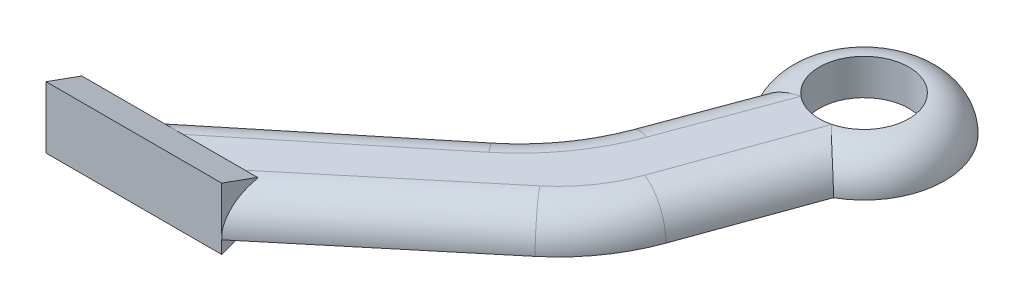
ISO-10303-21;
HEADER;
FILE_DESCRIPTION(('STEP AP214'),'2;1');
FILE_NAME('part.step','',(''),(''),'','','');
FILE_SCHEMA(('AUTOMOTIVE_DESIGN { 1 0 10303 214 1 1 1 1 }'));
ENDSEC;
DATA;
#1=APPLICATION_CONTEXT('core data for automotive mechanical design processes');
#2=APPLICATION_PROTOCOL_DEFINITION('international standard','automotive_design',2000,#1);
#3=PRODUCT_CONTEXT('',#1,'mechanical');
#4=PRODUCT('Part','Part','',(#3));
#5=PRODUCT_RELATED_PRODUCT_CATEGORY('part','',(#4));
#6=PRODUCT_DEFINITION_FORMATION('','',#4);
#7=PRODUCT_DEFINITION_CONTEXT('part definition',#1,'design');
#8=PRODUCT_DEFINITION('design','',#6,#7);
#9=PRODUCT_DEFINITION_SHAPE('','',#8);
#10=(LENGTH_UNIT() NAMED_UNIT(*) SI_UNIT(.MILLI.,.METRE.));
#11=(NAMED_UNIT(*) PLANE_ANGLE_UNIT() SI_UNIT($,.RADIAN.));
#12=(NAMED_UNIT(*) SI_UNIT($,.STERADIAN.) SOLID_ANGLE_UNIT());
#13=UNCERTAINTY_MEASURE_WITH_UNIT(LENGTH_MEASURE(1.E-05),#10,'distance_accuracy_value','');
#14=(GEOMETRIC_REPRESENTATION_CONTEXT(3) GLOBAL_UNCERTAINTY_ASSIGNED_CONTEXT((#13)) GLOBAL_UNIT_ASSIGNED_CONTEXT((#10,
#11,#12)) REPRESENTATION_CONTEXT('',''));
#15=CARTESIAN_POINT('',(0.,0.,0.));
#16=DIRECTION('',(0.,0.,1.));
#17=DIRECTION('',(1.,0.,0.));
#18=AXIS2_PLACEMENT_3D('',#15,#16,#17);
#19=CARTESIAN_POINT('',(11.4826257965562,2.,-14.3996307201945));
#20=DIRECTION('',(0.,1.,0.));
#21=DIRECTION('',(0.,0.,1.));
#22=AXIS2_PLACEMENT_3D('',#19,#20,#21);
#23=PLANE('',#22);
#24=DIRECTION('',(1.,0.,0.));
#25=VECTOR('',#24,1.);
#26=CARTESIAN_POINT('',(-11.15,2.,6.60036927980545));
#27=LINE('',#26,#25);
#28=CARTESIAN_POINT('',(-5.50829123776774,2.,6.60036927980545));
#29=VERTEX_POINT('',#28);
#30=CARTESIAN_POINT('',(-2.04227215778598,2.,6.60036927980545));
#31=VERTEX_POINT('',#30);
#32=EDGE_CURVE('E179',#29,#31,#27,.T.);
#33=ORIENTED_EDGE('',*,*,#32,.T.);
#34=DIRECTION('',(0.768811989561023,0.,-0.639474881998676));
#35=VECTOR('',#34,1.);
#36=CARTESIAN_POINT('',(6.92807142678192,2.,-0.860894960499203));
#37=LINE('',#36,#35);
#38=CARTESIAN_POINT('',(6.92807142678192,2.,-0.860894960499203));
#39=VERTEX_POINT('',#38);
#40=EDGE_CURVE('E216',#31,#39,#37,.T.);
#41=ORIENTED_EDGE('',*,*,#40,.T.);
#42=CARTESIAN_POINT('',(1.8122723707925,2.,-7.01139087698739));
#43=DIRECTION('',(0.,1.,0.));
#44=DIRECTION('',(0.,0.,1.));
#45=AXIS2_PLACEMENT_3D('',#42,#43,#44);
#46=CIRCLE('',#45,8.);
#47=CARTESIAN_POINT('',(9.3378989984167,2.,-4.29754787091764));
#48=VERTEX_POINT('',#47);
#49=EDGE_CURVE('E218',#39,#48,#46,.T.);
#50=ORIENTED_EDGE('',*,*,#49,.T.);
#51=DIRECTION('',(0.339230375758719,0.,-0.940703328453024));
#52=VECTOR('',#51,1.);
#53=CARTESIAN_POINT('',(11.812107756407,2.,-11.1586563690097));
#54=LINE('',#53,#52);
#55=CARTESIAN_POINT('',(12.1079729417804,2.,-11.9791057878793));
#56=VERTEX_POINT('',#55);
#57=EDGE_CURVE('E220',#48,#56,#54,.T.);
#58=ORIENTED_EDGE('',*,*,#57,.T.);
#59=CARTESIAN_POINT('',(11.4826257965562,2.,-14.3996307201945));
#60=DIRECTION('',(0.,1.,0.));
#61=DIRECTION('',(0.,0.,1.));
#62=AXIS2_PLACEMENT_3D('',#59,#60,#61);
#63=CIRCLE('',#62,2.5);
#64=CARTESIAN_POINT('',(9.88318716538032,2.,-12.4782260087654));
#65=VERTEX_POINT('',#64);
#66=EDGE_CURVE('E191',#65,#56,#63,.T.);
#67=ORIENTED_EDGE('',*,*,#66,.F.);
#68=DIRECTION('',(-0.347398248181745,0.,0.937717685212482));
#69=VECTOR('',#68,1.);
#70=CARTESIAN_POINT('',(7.5557513281761,2.,-6.19587496880874));
#71=LINE('',#70,#69);
#72=CARTESIAN_POINT('',(7.5557513281761,2.,-6.19587496880874));
#73=VERTEX_POINT('',#72);
#74=EDGE_CURVE('E60',#65,#73,#71,.T.);
#75=ORIENTED_EDGE('',*,*,#74,.T.);
#76=CARTESIAN_POINT('',(-3.69686089437368,2.,-10.3646539469897));
#77=DIRECTION('',(0.,1.,0.));
#78=DIRECTION('',(0.,0.,1.));
#79=AXIS2_PLACEMENT_3D('',#76,#77,#78);
#80=CIRCLE('',#79,12.);
#81=CARTESIAN_POINT('',(3.88908115511307,2.,-1.06661742190392));
#82=VERTEX_POINT('',#81);
#83=EDGE_CURVE('E225',#73,#82,#80,.F.);
#84=ORIENTED_EDGE('',*,*,#83,.T.);
#85=DIRECTION('',(-0.77483637709048,0.,0.632161837457229));
#86=VECTOR('',#85,1.);
#87=CARTESIAN_POINT('',(-9.85910049852519,2.,10.1500420339864));
#88=LINE('',#87,#86);
#89=EDGE_CURVE('E222',#82,#29,#88,.T.);
#90=ORIENTED_EDGE('',*,*,#89,.T.);
#91=EDGE_LOOP('',(#33,#41,#50,#58,#67,#75,#84,#90));
#92=FACE_BOUND('',#91,.T.);
#93=ADVANCED_FACE('F36',(#92),#23,.T.);
#94=CARTESIAN_POINT('',(11.4826257965562,0.,-14.3996307201945));
#95=DIRECTION('',(0.,1.,0.));
#96=DIRECTION('',(0.,0.,1.));
#97=AXIS2_PLACEMENT_3D('',#94,#95,#96);
#98=PLANE('',#97);
#99=DIRECTION('',(0.,0.,1.));
#100=VECTOR('',#99,1.);
#101=CARTESIAN_POINT('',(-1.35,0.,-14.3996307201945));
#102=LINE('',#101,#100);
#103=CARTESIAN_POINT('',(-1.35,0.,6.60036927980545));
#104=VERTEX_POINT('',#103);
#105=CARTESIAN_POINT('',(-1.35,0.,8.60036927980545));
#106=VERTEX_POINT('',#105);
#107=EDGE_CURVE('E141',#104,#106,#102,.T.);
#108=ORIENTED_EDGE('',*,*,#107,.F.);
#109=DIRECTION('',(1.,0.,0.));
#110=VECTOR('',#109,1.);
#111=CARTESIAN_POINT('',(-11.15,0.,6.60036927980545));
#112=LINE('',#111,#110);
#113=CARTESIAN_POINT('',(-8.67203805305271,0.,6.60036927980545));
#114=VERTEX_POINT('',#113);
#115=EDGE_CURVE('E153',#114,#104,#112,.T.);
#116=ORIENTED_EDGE('',*,*,#115,.F.);
#117=DIRECTION('',(-0.77483637709048,0.,0.632161837457229));
#118=VECTOR('',#117,1.);
#119=CARTESIAN_POINT('',(4.73443918794363,0.,-4.33750552457679));
#120=LINE('',#119,#118);
#121=CARTESIAN_POINT('',(2.62475748019861,0.,-2.61629017608488));
#122=VERTEX_POINT('',#121);
#123=EDGE_CURVE('E198',#122,#114,#120,.T.);
#124=ORIENTED_EDGE('',*,*,#123,.F.);
#125=CARTESIAN_POINT('',(-3.69686089437368,0.,-10.3646539469897));
#126=DIRECTION('',(0.,1.,0.));
#127=DIRECTION('',(0.,0.,1.));
#128=AXIS2_PLACEMENT_3D('',#125,#126,#127);
#129=CIRCLE('',#128,10.);
#130=CARTESIAN_POINT('',(5.68031595775114,0.,-6.89067146517223));
#131=VERTEX_POINT('',#130);
#132=EDGE_CURVE('E214',#122,#131,#129,.T.);
#133=ORIENTED_EDGE('',*,*,#132,.T.);
#134=DIRECTION('',(-0.347398248181745,0.,0.937717685212482));
#135=VECTOR('',#134,1.);
#136=CARTESIAN_POINT('',(7.61190342688268,0.,-12.1045254204515));
#137=LINE('',#136,#135);
#138=CARTESIAN_POINT('',(7.61190342688268,0.,-12.1045254204515));
#139=VERTEX_POINT('',#138);
#140=EDGE_CURVE('E190',#139,#131,#137,.T.);
#141=ORIENTED_EDGE('',*,*,#140,.F.);
#142=CARTESIAN_POINT('',(11.4826257965562,0.,-14.3996307201945));
#143=DIRECTION('',(0.,1.,0.));
#144=DIRECTION('',(0.,0.,1.));
#145=AXIS2_PLACEMENT_3D('',#142,#143,#144);
#146=CIRCLE('',#145,4.5);
#147=CARTESIAN_POINT('',(13.693514413313,0.,-10.4801956174922));
#148=VERTEX_POINT('',#147);
#149=EDGE_CURVE('E209',#148,#139,#146,.T.);
#150=ORIENTED_EDGE('',*,*,#149,.F.);
#151=DIRECTION('',(0.339230375758719,0.,-0.940703328453024));
#152=VECTOR('',#151,1.);
#153=CARTESIAN_POINT('',(10.2970860518292,0.,-1.06172459362196));
#154=LINE('',#153,#152);
#155=CARTESIAN_POINT('',(11.2193056553227,0.,-3.6190871194002));
#156=VERTEX_POINT('',#155);
#157=EDGE_CURVE('E206',#156,#148,#154,.T.);
#158=ORIENTED_EDGE('',*,*,#157,.F.);
#159=CARTESIAN_POINT('',(1.8122723707925,0.,-7.01139087698739));
#160=DIRECTION('',(0.,1.,0.));
#161=DIRECTION('',(0.,0.,1.));
#162=AXIS2_PLACEMENT_3D('',#159,#160,#161);
#163=CIRCLE('',#162,10.);
#164=CARTESIAN_POINT('',(8.20702119077927,0.,0.676729018622842));
#165=VERTEX_POINT('',#164);
#166=EDGE_CURVE('E212',#156,#165,#163,.F.);
#167=ORIENTED_EDGE('',*,*,#166,.T.);
#168=DIRECTION('',(0.768811989561023,0.,-0.639474881998676));
#169=VECTOR('',#168,1.);
#170=CARTESIAN_POINT('',(-1.31921636014026,0.,8.60036927980545));
#171=LINE('',#170,#169);
#172=CARTESIAN_POINT('',(-1.31921636014026,0.,8.60036927980545));
#173=VERTEX_POINT('',#172);
#174=EDGE_CURVE('E203',#173,#165,#171,.T.);
#175=ORIENTED_EDGE('',*,*,#174,.F.);
#176=DIRECTION('',(1.,0.,0.));
#177=VECTOR('',#176,1.);
#178=CARTESIAN_POINT('',(-11.1234241734397,0.,8.60036927980545));
#179=LINE('',#178,#177);
#180=EDGE_CURVE('E201',#106,#173,#179,.T.);
#181=ORIENTED_EDGE('',*,*,#180,.F.);
#182=EDGE_LOOP('',(#108,#116,#124,#133,#141,#150,#158,#167,#175,#181));
#183=FACE_BOUND('',#182,.T.);
#184=CARTESIAN_POINT('',(11.4826257965562,0.,-14.3996307201945));
#185=DIRECTION('',(0.,1.,0.));
#186=DIRECTION('',(0.,0.,1.));
#187=AXIS2_PLACEMENT_3D('',#184,#185,#186);
#188=CIRCLE('',#187,2.5);
#189=CARTESIAN_POINT('',(11.4826257965562,0.,-11.8996307201945));
#190=VERTEX_POINT('',#189);
#191=EDGE_CURVE('E192',#190,#190,#188,.T.);
#192=ORIENTED_EDGE('',*,*,#191,.T.);
#193=EDGE_LOOP('',(#192));
#194=FACE_BOUND('',#193,.T.);
#195=ADVANCED_FACE('F282',(#183,#194),#98,.F.);
#196=CARTESIAN_POINT('',(-11.1234241734397,2.,8.60036927980545));
#197=DIRECTION('',(0.,0.,-1.));
#198=DIRECTION('',(-1.,0.,0.));
#199=AXIS2_PLACEMENT_3D('',#196,#197,#198);
#200=PLANE('',#199);
#201=DIRECTION('',(0.,-1.,0.));
#202=VECTOR('',#201,1.);
#203=CARTESIAN_POINT('',(-1.35,-0.725,8.60036927980545));
#204=LINE('',#203,#202);
#205=CARTESIAN_POINT('',(-1.35,-0.725,8.60036927980545));
#206=VERTEX_POINT('',#205);
#207=EDGE_CURVE('E135',#106,#206,#204,.T.);
#208=ORIENTED_EDGE('',*,*,#207,.F.);
#209=ORIENTED_EDGE('',*,*,#180,.T.);
#210=CARTESIAN_POINT('',(-4.44678251840594,0.,8.60036927980545));
#211=DIRECTION('',(0.,0.,-1.));
#212=DIRECTION('',(-1.,0.,0.));
#213=AXIS2_PLACEMENT_3D('',#210,#211,#212);
#214=ELLIPSE('',#213,3.12756615826568,2.);
#215=CARTESIAN_POINT('',(-1.35,0.279917745584298,8.60036927980545));
#216=VERTEX_POINT('',#215);
#217=EDGE_CURVE('E228',#173,#216,#214,.F.);
#218=ORIENTED_EDGE('',*,*,#217,.T.);
#219=CARTESIAN_POINT('',(-1.35,2.725,8.60036927980545));
#220=VERTEX_POINT('',#219);
#221=EDGE_CURVE('E52',#220,#216,#204,.T.);
#222=ORIENTED_EDGE('',*,*,#221,.F.);
#223=DIRECTION('',(1.,0.,0.));
#224=VECTOR('',#223,1.);
#225=CARTESIAN_POINT('',(-11.15,2.725,8.60036927980545));
#226=LINE('',#225,#224);
#227=CARTESIAN_POINT('',(-11.15,2.725,8.60036927980545));
#228=VERTEX_POINT('',#227);
#229=EDGE_CURVE('E174',#228,#220,#226,.T.);
#230=ORIENTED_EDGE('',*,*,#229,.F.);
#231=DIRECTION('',(0.,-1.,0.));
#232=VECTOR('',#231,1.);
#233=CARTESIAN_POINT('',(-11.15,-0.725,8.60036927980545));
#234=LINE('',#233,#232);
#235=CARTESIAN_POINT('',(-11.15,-0.725,8.60036927980545));
#236=VERTEX_POINT('',#235);
#237=EDGE_CURVE('E149',#228,#236,#234,.T.);
#238=ORIENTED_EDGE('',*,*,#237,.T.);
#239=DIRECTION('',(1.,0.,0.));
#240=VECTOR('',#239,1.);
#241=CARTESIAN_POINT('',(-11.15,-0.725,8.60036927980545));
#242=LINE('',#241,#240);
#243=EDGE_CURVE('E146',#236,#206,#242,.T.);
#244=ORIENTED_EDGE('',*,*,#243,.T.);
#245=EDGE_LOOP('',(#208,#209,#218,#222,#230,#238,#244));
#246=FACE_BOUND('',#245,.T.);
#247=ADVANCED_FACE('F147',(#246),#200,.F.);
#248=CARTESIAN_POINT('',(11.4826257965562,2.,-14.3996307201945));
#249=DIRECTION('',(0.,-1.,0.));
#250=DIRECTION('',(0.,0.,-1.));
#251=AXIS2_PLACEMENT_3D('',#248,#249,#250);
#252=CYLINDRICAL_SURFACE('',#251,2.5);
#253=EDGE_CURVE('E187',#56,#65,#63,.T.);
#254=ORIENTED_EDGE('',*,*,#253,.T.);
#255=ORIENTED_EDGE('',*,*,#66,.T.);
#256=EDGE_LOOP('',(#254,#255));
#257=FACE_BOUND('',#256,.T.);
#258=ORIENTED_EDGE('',*,*,#191,.F.);
#259=EDGE_LOOP('',(#258));
#260=FACE_BOUND('',#259,.T.);
#261=ADVANCED_FACE('F266',(#257,#260),#252,.F.);
#262=CARTESIAN_POINT('',(14.9788313460514,0.,-10.1143558411684));
#263=DIRECTION('',(0.77483637709048,0.,-0.632161837457229));
#264=DIRECTION('',(-0.632161837457229,0.,-0.77483637709048));
#265=AXIS2_PLACEMENT_3D('',#262,#263,#264);
#266=CYLINDRICAL_SURFACE('',#265,2.);
#267=CARTESIAN_POINT('',(-5.50829123776774,0.,6.60036927980545));
#268=DIRECTION('',(0.,0.,-1.));
#269=DIRECTION('',(1.,0.,0.));
#270=AXIS2_PLACEMENT_3D('',#267,#268,#269);
#271=ELLIPSE('',#270,3.16374681528496,2.);
#272=EDGE_CURVE('E184',#29,#114,#271,.F.);
#273=ORIENTED_EDGE('',*,*,#272,.F.);
#274=ORIENTED_EDGE('',*,*,#89,.F.);
#275=CARTESIAN_POINT('',(3.88908115511307,0.,-1.06661742190392));
#276=DIRECTION('',(0.77483637709048,0.,-0.632161837457229));
#277=DIRECTION('',(-0.632161837457229,0.,-0.77483637709048));
#278=AXIS2_PLACEMENT_3D('',#275,#276,#277);
#279=CIRCLE('',#278,2.);
#280=EDGE_CURVE('E195',#122,#82,#279,.T.);
#281=ORIENTED_EDGE('',*,*,#280,.F.);
#282=ORIENTED_EDGE('',*,*,#123,.T.);
#283=EDGE_LOOP('',(#273,#274,#281,#282));
#284=FACE_BOUND('',#283,.T.);
#285=ADVANCED_FACE('F263',(#284),#266,.T.);
#286=CARTESIAN_POINT('',(-3.69686089437368,0.,-10.3646539469897));
#287=DIRECTION('',(0.,1.,0.));
#288=DIRECTION('',(0.,0.,1.));
#289=AXIS2_PLACEMENT_3D('',#286,#287,#288);
#290=TOROIDAL_SURFACE('',#289,12.,2.);
#291=ORIENTED_EDGE('',*,*,#280,.T.);
#292=ORIENTED_EDGE('',*,*,#83,.F.);
#293=CARTESIAN_POINT('',(7.5557513281761,0.,-6.19587496880874));
#294=DIRECTION('',(0.347398248181745,0.,-0.937717685212482));
#295=DIRECTION('',(-0.937717685212482,0.,-0.347398248181745));
#296=AXIS2_PLACEMENT_3D('',#293,#294,#295);
#297=CIRCLE('',#296,2.);
#298=EDGE_CURVE('E232',#131,#73,#297,.T.);
#299=ORIENTED_EDGE('',*,*,#298,.F.);
#300=ORIENTED_EDGE('',*,*,#132,.F.);
#301=EDGE_LOOP('',(#291,#292,#299,#300));
#302=FACE_BOUND('',#301,.T.);
#303=ADVANCED_FACE('F259',(#302),#290,.T.);
#304=CARTESIAN_POINT('',(10.7021359294715,0.,-14.6887804470523));
#305=DIRECTION('',(0.347398248181745,0.,-0.937717685212482));
#306=DIRECTION('',(-0.937717685212482,0.,-0.347398248181745));
#307=AXIS2_PLACEMENT_3D('',#304,#305,#306);
#308=CYLINDRICAL_SURFACE('',#307,2.);
#309=ORIENTED_EDGE('',*,*,#74,.F.);
#310=CARTESIAN_POINT('',(7.61190342688268,0.,-12.1045254204515));
#311=CARTESIAN_POINT('',(7.61189543352078,0.0520283875366276,-12.1045262232534));
#312=CARTESIAN_POINT('',(7.61414339430645,0.104052964419755,-12.1047280739774));
#313=CARTESIAN_POINT('',(7.62308994926808,0.207704438460941,-12.105539429095));
#314=CARTESIAN_POINT('',(7.62978763009234,0.259331415031186,-12.1061488498307));
#315=CARTESIAN_POINT('',(7.6475467799877,0.361671672877254,-12.1077785477575));
#316=CARTESIAN_POINT('',(7.65859562252087,0.412387157839133,-12.1087976363189));
#317=CARTESIAN_POINT('',(7.68492912514579,0.512681922597367,-12.1112567415172));
#318=CARTESIAN_POINT('',(7.70021385815536,0.56226118281852,-12.1126967654001));
#319=CARTESIAN_POINT('',(7.75219834246821,0.708747710079285,-12.1176685979388));
#320=CARTESIAN_POINT('',(7.79504999413708,0.803526311350247,-12.1218540280005));
#321=CARTESIAN_POINT('',(7.89544489323164,0.984780760737217,-12.1321135387336));
#322=CARTESIAN_POINT('',(7.95299390003438,1.07125333569153,-12.1381883599949));
#323=CARTESIAN_POINT('',(8.08277301030972,1.23668369975567,-12.1526471361493));
#324=CARTESIAN_POINT('',(8.15541305794058,1.31531355918635,-12.1610986019576));
#325=CARTESIAN_POINT('',(8.31166308370237,1.46038071036489,-12.1804522363457));
#326=CARTESIAN_POINT('',(8.39527542737518,1.52681536549118,-12.1913549337545));
#327=CARTESIAN_POINT('',(8.57861945643107,1.65190834001899,-12.2169281844484));
#328=CARTESIAN_POINT('',(8.67912074017512,1.70938631810406,-12.23184411115));
#329=CARTESIAN_POINT('',(8.88709032135319,1.80864778032583,-12.2651943235526));
#330=CARTESIAN_POINT('',(8.99456485297788,1.85041698742653,-12.2836317869956));
#331=CARTESIAN_POINT('',(9.22965456264571,1.9234054525493,-12.327317552917));
#332=CARTESIAN_POINT('',(9.35791266490508,1.95218060470861,-12.3531680620895));
#333=CARTESIAN_POINT('',(9.61586564248934,1.99024937910358,-12.4103304088893));
#334=CARTESIAN_POINT('',(9.74555771894426,1.99957588859287,-12.4416329299716));
#335=CARTESIAN_POINT('',(9.87725407027953,1.99999530365834,-12.4766436593888));
#336=CARTESIAN_POINT('',(9.88022088463565,2.00000001596779,-12.4774340574169));
#337=CARTESIAN_POINT('',(9.88318716538032,2.,-12.4782260087654));
#338=B_SPLINE_CURVE_WITH_KNOTS('',3,(#310,#311,#312,#313,#314,#315,#316,#317,#318,#319,#320,
#321,#322,#323,#324,#325,#326,#327,#328,#329,#330,#331,#332,#333,#334,#335,#336,#337),
.UNSPECIFIED.,.F.,.F.,(4,2,2,2,2,2,2,2,2,2,2,2,2,4),(0.,0.156029713161231,0.312027409478255,
0.467575716396317,0.62312670113319,0.933859930965681,1.24471511357013,1.5654916485293,
1.88633745438656,2.23511270915112,2.58420418928672,2.98446938566176,3.38405719116916,
3.39326806890228),.UNSPECIFIED.);
#339=EDGE_CURVE('E231',#65,#139,#338,.F.);
#340=ORIENTED_EDGE('',*,*,#339,.T.);
#341=ORIENTED_EDGE('',*,*,#140,.T.);
#342=ORIENTED_EDGE('',*,*,#298,.T.);
#343=EDGE_LOOP('',(#309,#340,#341,#342));
#344=FACE_BOUND('',#343,.T.);
#345=ADVANCED_FACE('F253',(#344),#308,.T.);
#346=CARTESIAN_POINT('',(16.2762697216083,0.,-8.63644747873922));
#347=DIRECTION('',(-0.768811989561023,0.,0.639474881998676));
#348=DIRECTION('',(0.639474881998676,0.,0.768811989561023));
#349=AXIS2_PLACEMENT_3D('',#346,#347,#348);
#350=CYLINDRICAL_SURFACE('',#349,2.);
#351=CARTESIAN_POINT('',(-2.04227215778598,0.,6.60036927980545));
#352=DIRECTION('',(0.,0.,-1.));
#353=DIRECTION('',(-1.,0.,0.));
#354=AXIS2_PLACEMENT_3D('',#351,#352,#353);
#355=ELLIPSE('',#354,3.12756615826568,2.);
#356=CARTESIAN_POINT('',(-1.35,1.95039098201521,6.60036927980545));
#357=VERTEX_POINT('',#356);
#358=EDGE_CURVE('E11',#357,#31,#355,.F.);
#359=ORIENTED_EDGE('',*,*,#358,.F.);
#360=CARTESIAN_POINT('',(-1.35,0.,6.02455794696721));
#361=DIRECTION('',(-1.,0.,0.));
#362=DIRECTION('',(0.,0.,1.));
#363=AXIS2_PLACEMENT_3D('',#360,#361,#362);
#364=ELLIPSE('',#363,2.60141624630745,2.);
#365=EDGE_CURVE('E45',#357,#216,#364,.F.);
#366=ORIENTED_EDGE('',*,*,#365,.T.);
#367=ORIENTED_EDGE('',*,*,#217,.F.);
#368=ORIENTED_EDGE('',*,*,#174,.T.);
#369=CARTESIAN_POINT('',(6.92807142678192,0.,-0.860894960499203));
#370=DIRECTION('',(0.768811989561023,0.,-0.639474881998676));
#371=DIRECTION('',(-0.639474881998676,0.,-0.768811989561023));
#372=AXIS2_PLACEMENT_3D('',#369,#370,#371);
#373=CIRCLE('',#372,2.);
#374=EDGE_CURVE('E234',#39,#165,#373,.T.);
#375=ORIENTED_EDGE('',*,*,#374,.F.);
#376=ORIENTED_EDGE('',*,*,#40,.F.);
#377=EDGE_LOOP('',(#359,#366,#367,#368,#375,#376));
#378=FACE_BOUND('',#377,.T.);
#379=ADVANCED_FACE('F258',(#378),#350,.T.);
#380=CARTESIAN_POINT('',(1.8122723707925,0.,-7.01139087698739));
#381=DIRECTION('',(0.,1.,0.));
#382=DIRECTION('',(0.,0.,1.));
#383=AXIS2_PLACEMENT_3D('',#380,#381,#382);
#384=TOROIDAL_SURFACE('',#383,8.,2.);
#385=ORIENTED_EDGE('',*,*,#374,.T.);
#386=ORIENTED_EDGE('',*,*,#166,.F.);
#387=CARTESIAN_POINT('',(9.3378989984167,0.,-4.29754787091764));
#388=DIRECTION('',(0.339230375758719,0.,-0.940703328453024));
#389=DIRECTION('',(-0.940703328453024,0.,-0.339230375758719));
#390=AXIS2_PLACEMENT_3D('',#387,#388,#389);
#391=CIRCLE('',#390,2.);
#392=EDGE_CURVE('E186',#48,#156,#391,.T.);
#393=ORIENTED_EDGE('',*,*,#392,.F.);
#394=ORIENTED_EDGE('',*,*,#49,.F.);
#395=EDGE_LOOP('',(#385,#386,#393,#394));
#396=FACE_BOUND('',#395,.T.);
#397=ADVANCED_FACE('F272',(#396),#384,.T.);
#398=CARTESIAN_POINT('',(12.8084358747006,0.,-13.921525628621));
#399=DIRECTION('',(-0.339230375758719,0.,0.940703328453024));
#400=DIRECTION('',(0.940703328453024,0.,0.339230375758719));
#401=AXIS2_PLACEMENT_3D('',#398,#399,#400);
#402=CYLINDRICAL_SURFACE('',#401,2.);
#403=ORIENTED_EDGE('',*,*,#392,.T.);
#404=ORIENTED_EDGE('',*,*,#157,.T.);
#405=CARTESIAN_POINT('',(13.693514413313,0.,-10.4801956174922));
#406=CARTESIAN_POINT('',(13.6935206015833,0.0535290515420343,-10.4801920632802));
#407=CARTESIAN_POINT('',(13.6917636364918,0.107054740295363,-10.4816752709105));
#408=CARTESIAN_POINT('',(13.6847706272418,0.213707040085185,-10.4875874777269));
#409=CARTESIAN_POINT('',(13.6795350977507,0.266833708982499,-10.4920160411361));
#410=CARTESIAN_POINT('',(13.6656469622341,0.372199391018941,-10.5037787069259));
#411=CARTESIAN_POINT('',(13.6570016554297,0.424440053275847,-10.5111066028867));
#412=CARTESIAN_POINT('',(13.6363943848645,0.527763440286034,-10.5286070655638));
#413=CARTESIAN_POINT('',(13.6244323997996,0.578846157599189,-10.5387796505525));
#414=CARTESIAN_POINT('',(13.5837393605981,0.72981961748166,-10.5734676457845));
#415=CARTESIAN_POINT('',(13.5501882878966,0.827532252330864,-10.6021641468197));
#416=CARTESIAN_POINT('',(13.4716192624409,1.01432148114702,-10.6698749951854));
#417=CARTESIAN_POINT('',(13.4265992827097,1.10339654469186,-10.7088911664272));
#418=CARTESIAN_POINT('',(13.3257203823923,1.27266520062614,-10.7971814060579));
#419=CARTESIAN_POINT('',(13.2696490582893,1.35262641398134,-10.8466581543752));
#420=CARTESIAN_POINT('',(13.1493973648619,1.49968892387532,-10.9541068178581));
#421=CARTESIAN_POINT('',(13.0852150322487,1.56678709695409,-11.0120807903417));
#422=CARTESIAN_POINT('',(12.9471257908999,1.69039080440248,-11.1387261646872));
#423=CARTESIAN_POINT('',(12.8728736116376,1.74607833520236,-11.2078181125366));
#424=CARTESIAN_POINT('',(12.7203459894761,1.84109280374306,-11.3525316463373));
#425=CARTESIAN_POINT('',(12.6420687196115,1.88041223712326,-11.4281562081838));
#426=CARTESIAN_POINT('',(12.4882816488727,1.94083975024881,-11.5802164512471));
#427=CARTESIAN_POINT('',(12.412847993636,1.96280998501108,-11.6563920333859));
#428=CARTESIAN_POINT('',(12.2627109958039,1.99215718070933,-11.811982496122));
#429=CARTESIAN_POINT('',(12.1880065576385,1.99956114975142,-11.891391102499));
#430=CARTESIAN_POINT('',(12.11239205861,1.9999937079616,-11.9742562173392));
#431=CARTESIAN_POINT('',(12.1101818959228,2.0000000195465,-11.9766805427118));
#432=CARTESIAN_POINT('',(12.1079729417804,2.,-11.9791057878793));
#433=B_SPLINE_CURVE_WITH_KNOTS('',3,(#405,#406,#407,#408,#409,#410,#411,#412,#413,#414,#415,
#416,#417,#418,#419,#420,#421,#422,#423,#424,#425,#426,#427,#428,#429,#430,#431,#432),
.UNSPECIFIED.,.F.,.F.,(4,2,2,2,2,2,2,2,2,2,2,2,2,4),(0.,0.16053195849016,0.321040170924062,
0.481206636430515,0.641374130760214,0.961418689782529,1.28151985172015,1.60850954501276,
1.93557853908486,2.28122266166902,2.62702507931526,2.95431744541945,3.28100238685324,
3.29084409847999),.UNSPECIFIED.);
#434=EDGE_CURVE('E247',#148,#56,#433,.T.);
#435=ORIENTED_EDGE('',*,*,#434,.T.);
#436=ORIENTED_EDGE('',*,*,#57,.F.);
#437=EDGE_LOOP('',(#403,#404,#435,#436));
#438=FACE_BOUND('',#437,.T.);
#439=ADVANCED_FACE('F268',(#438),#402,.T.);
#440=CARTESIAN_POINT('',(11.4826257965562,0.,-14.3996307201945));
#441=DIRECTION('',(0.,1.,0.));
#442=DIRECTION('',(0.,0.,1.));
#443=AXIS2_PLACEMENT_3D('',#440,#441,#442);
#444=TOROIDAL_SURFACE('',#443,2.5,2.);
#445=ORIENTED_EDGE('',*,*,#434,.F.);
#446=ORIENTED_EDGE('',*,*,#149,.T.);
#447=ORIENTED_EDGE('',*,*,#339,.F.);
#448=ORIENTED_EDGE('',*,*,#253,.F.);
#449=EDGE_LOOP('',(#445,#446,#447,#448));
#450=FACE_BOUND('',#449,.T.);
#451=ADVANCED_FACE('F38',(#450),#444,.T.);
#452=CARTESIAN_POINT('',(-11.15,2.,6.60036927980545));
#453=DIRECTION('',(0.,0.,-1.));
#454=DIRECTION('',(-1.,0.,0.));
#455=AXIS2_PLACEMENT_3D('',#452,#453,#454);
#456=PLANE('',#455);
#457=CARTESIAN_POINT('',(-11.15,2.,6.60036927980545));
#458=VERTEX_POINT('',#457);
#459=EDGE_CURVE('E176',#458,#29,#27,.T.);
#460=ORIENTED_EDGE('',*,*,#459,.T.);
#461=ORIENTED_EDGE('',*,*,#272,.T.);
#462=CARTESIAN_POINT('',(-11.15,0.,6.60036927980545));
#463=VERTEX_POINT('',#462);
#464=EDGE_CURVE('E181',#463,#114,#112,.T.);
#465=ORIENTED_EDGE('',*,*,#464,.F.);
#466=DIRECTION('',(0.,1.,0.));
#467=VECTOR('',#466,1.);
#468=CARTESIAN_POINT('',(-11.15,2.,6.60036927980545));
#469=LINE('',#468,#467);
#470=EDGE_CURVE('E169',#463,#458,#469,.T.);
#471=ORIENTED_EDGE('',*,*,#470,.T.);
#472=EDGE_LOOP('',(#460,#461,#465,#471));
#473=FACE_BOUND('',#472,.T.);
#474=ADVANCED_FACE('F302',(#473),#456,.T.);
#475=CARTESIAN_POINT('',(-1.35,0.,0.));
#476=DIRECTION('',(-1.,0.,0.));
#477=DIRECTION('',(0.,0.,1.));
#478=AXIS2_PLACEMENT_3D('',#475,#476,#477);
#479=PLANE('',#478);
#480=DIRECTION('',(0.,0.3407993236214,-0.940136065162483));
#481=VECTOR('',#480,1.);
#482=CARTESIAN_POINT('',(-1.35,0.,6.60036927980545));
#483=LINE('',#482,#481);
#484=EDGE_CURVE('E139',#206,#104,#483,.T.);
#485=ORIENTED_EDGE('',*,*,#484,.T.);
#486=ORIENTED_EDGE('',*,*,#107,.T.);
#487=ORIENTED_EDGE('',*,*,#207,.T.);
#488=EDGE_LOOP('',(#485,#486,#487));
#489=FACE_BOUND('',#488,.T.);
#490=ADVANCED_FACE('F137',(#489),#479,.F.);
#491=CARTESIAN_POINT('',(-11.15,2.725,8.60036927980545));
#492=DIRECTION('',(0.,0.940136065162483,-0.3407993236214));
#493=DIRECTION('',(0.,0.3407993236214,0.940136065162483));
#494=AXIS2_PLACEMENT_3D('',#491,#492,#493);
#495=PLANE('',#494);
#496=ORIENTED_EDGE('',*,*,#229,.T.);
#497=DIRECTION('',(0.,0.3407993236214,0.940136065162483));
#498=VECTOR('',#497,1.);
#499=CARTESIAN_POINT('',(-1.35,2.725,8.60036927980545));
#500=LINE('',#499,#498);
#501=CARTESIAN_POINT('',(-1.35,2.,6.60036927980545));
#502=VERTEX_POINT('',#501);
#503=EDGE_CURVE('E162',#502,#220,#500,.T.);
#504=ORIENTED_EDGE('',*,*,#503,.F.);
#505=EDGE_CURVE('E180',#31,#502,#27,.T.);
#506=ORIENTED_EDGE('',*,*,#505,.F.);
#507=ORIENTED_EDGE('',*,*,#32,.F.);
#508=ORIENTED_EDGE('',*,*,#459,.F.);
#509=DIRECTION('',(0.,0.3407993236214,0.940136065162483));
#510=VECTOR('',#509,1.);
#511=CARTESIAN_POINT('',(-11.15,2.725,8.60036927980545));
#512=LINE('',#511,#510);
#513=EDGE_CURVE('E154',#458,#228,#512,.T.);
#514=ORIENTED_EDGE('',*,*,#513,.T.);
#515=EDGE_LOOP('',(#496,#504,#506,#507,#508,#514));
#516=FACE_BOUND('',#515,.T.);
#517=ADVANCED_FACE('F300',(#516),#495,.T.);
#518=DIRECTION('',(0.,1.,0.));
#519=VECTOR('',#518,1.);
#520=CARTESIAN_POINT('',(-1.35,2.,6.60036927980545));
#521=LINE('',#520,#519);
#522=EDGE_CURVE('E159',#357,#502,#521,.T.);
#523=ORIENTED_EDGE('',*,*,#522,.F.);
#524=ORIENTED_EDGE('',*,*,#358,.T.);
#525=ORIENTED_EDGE('',*,*,#505,.T.);
#526=EDGE_LOOP('',(#523,#524,#525));
#527=FACE_BOUND('',#526,.T.);
#528=ADVANCED_FACE('F297',(#527),#456,.T.);
#529=CARTESIAN_POINT('',(-11.15,0.,6.60036927980545));
#530=DIRECTION('',(0.,-0.940136065162483,-0.3407993236214));
#531=DIRECTION('',(0.,0.3407993236214,-0.940136065162483));
#532=AXIS2_PLACEMENT_3D('',#529,#530,#531);
#533=PLANE('',#532);
#534=ORIENTED_EDGE('',*,*,#464,.T.);
#535=ORIENTED_EDGE('',*,*,#115,.T.);
#536=ORIENTED_EDGE('',*,*,#484,.F.);
#537=ORIENTED_EDGE('',*,*,#243,.F.);
#538=DIRECTION('',(0.,0.3407993236214,-0.940136065162483));
#539=VECTOR('',#538,1.);
#540=CARTESIAN_POINT('',(-11.15,0.,6.60036927980545));
#541=LINE('',#540,#539);
#542=EDGE_CURVE('E167',#236,#463,#541,.T.);
#543=ORIENTED_EDGE('',*,*,#542,.T.);
#544=EDGE_LOOP('',(#534,#535,#536,#537,#543));
#545=FACE_BOUND('',#544,.T.);
#546=ADVANCED_FACE('F157',(#545),#533,.T.);
#547=CARTESIAN_POINT('',(-11.15,0.,0.));
#548=DIRECTION('',(-1.,0.,0.));
#549=DIRECTION('',(0.,0.,1.));
#550=AXIS2_PLACEMENT_3D('',#547,#548,#549);
#551=PLANE('',#550);
#552=ORIENTED_EDGE('',*,*,#237,.F.);
#553=ORIENTED_EDGE('',*,*,#513,.F.);
#554=ORIENTED_EDGE('',*,*,#470,.F.);
#555=ORIENTED_EDGE('',*,*,#542,.F.);
#556=EDGE_LOOP('',(#552,#553,#554,#555));
#557=FACE_BOUND('',#556,.T.);
#558=ADVANCED_FACE('F296',(#557),#551,.T.);
#559=ORIENTED_EDGE('',*,*,#365,.F.);
#560=ORIENTED_EDGE('',*,*,#522,.T.);
#561=ORIENTED_EDGE('',*,*,#503,.T.);
#562=ORIENTED_EDGE('',*,*,#221,.T.);
#563=EDGE_LOOP('',(#559,#560,#561,#562));
#564=FACE_BOUND('',#563,.T.);
#565=ADVANCED_FACE('F308',(#564),#479,.F.);
#566=CLOSED_SHELL('',(#93,#195,#247,#261,#285,#303,#345,#379,#397,#439,#451,#474,#490,#517,#528,
#546,#558,#565));
#567=MANIFOLD_SOLID_BREP('B2',#566);
#568=ADVANCED_BREP_SHAPE_REPRESENTATION('',(#18,#567),#14);
#569=SHAPE_DEFINITION_REPRESENTATION(#9,#568);
ENDSEC;
END-ISO-10303-21;
